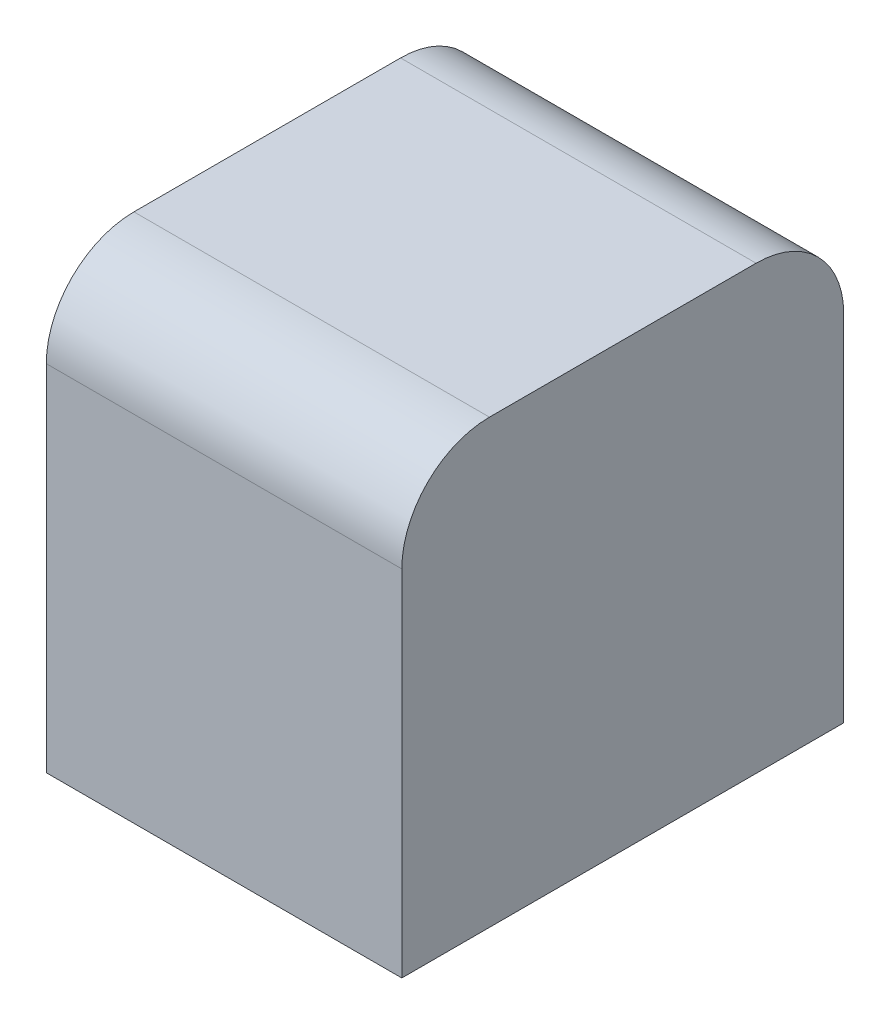
ISO-10303-21;
HEADER;
FILE_DESCRIPTION(('STEP AP214'),'2;1');
FILE_NAME('part.step','',(''),(''),'','','');
FILE_SCHEMA(('AUTOMOTIVE_DESIGN { 1 0 10303 214 1 1 1 1 }'));
ENDSEC;
DATA;
#1=APPLICATION_CONTEXT('core data for automotive mechanical design processes');
#2=APPLICATION_PROTOCOL_DEFINITION('international standard','automotive_design',2000,#1);
#3=PRODUCT_CONTEXT('',#1,'mechanical');
#4=PRODUCT('Part','Part','',(#3));
#5=PRODUCT_RELATED_PRODUCT_CATEGORY('part','',(#4));
#6=PRODUCT_DEFINITION_FORMATION('','',#4);
#7=PRODUCT_DEFINITION_CONTEXT('part definition',#1,'design');
#8=PRODUCT_DEFINITION('design','',#6,#7);
#9=PRODUCT_DEFINITION_SHAPE('','',#8);
#10=(LENGTH_UNIT() NAMED_UNIT(*) SI_UNIT(.MILLI.,.METRE.));
#11=(NAMED_UNIT(*) PLANE_ANGLE_UNIT() SI_UNIT($,.RADIAN.));
#12=(NAMED_UNIT(*) SI_UNIT($,.STERADIAN.) SOLID_ANGLE_UNIT());
#13=UNCERTAINTY_MEASURE_WITH_UNIT(LENGTH_MEASURE(1.E-05),#10,'distance_accuracy_value','');
#14=(GEOMETRIC_REPRESENTATION_CONTEXT(3) GLOBAL_UNCERTAINTY_ASSIGNED_CONTEXT((#13)) GLOBAL_UNIT_ASSIGNED_CONTEXT((#10,
#11,#12)) REPRESENTATION_CONTEXT('',''));
#15=CARTESIAN_POINT('',(0.,0.,0.));
#16=DIRECTION('',(0.,0.,1.));
#17=DIRECTION('',(1.,0.,0.));
#18=AXIS2_PLACEMENT_3D('',#15,#16,#17);
#19=CARTESIAN_POINT('',(0.2,0.,-0.25));
#20=DIRECTION('',(-1.,0.,0.));
#21=DIRECTION('',(0.,0.,1.));
#22=AXIS2_PLACEMENT_3D('',#19,#20,#21);
#23=PLANE('',#22);
#24=CARTESIAN_POINT('',(0.2,0.4,0.15));
#25=DIRECTION('',(1.,0.,0.));
#26=DIRECTION('',(0.,1.,0.));
#27=AXIS2_PLACEMENT_3D('',#24,#25,#26);
#28=CIRCLE('',#27,0.0986);
#29=CARTESIAN_POINT('',(0.2,0.4986,0.15));
#30=VERTEX_POINT('',#29);
#31=CARTESIAN_POINT('',(0.2,0.4,0.2486));
#32=VERTEX_POINT('',#31);
#33=EDGE_CURVE('E11',#30,#32,#28,.T.);
#34=ORIENTED_EDGE('',*,*,#33,.T.);
#35=DIRECTION('',(0.,1.,0.));
#36=VECTOR('',#35,1.);
#37=CARTESIAN_POINT('',(0.2,0.0014,0.2486));
#38=LINE('',#37,#36);
#39=CARTESIAN_POINT('',(0.2,0.0014,0.2486));
#40=VERTEX_POINT('',#39);
#41=EDGE_CURVE('E25',#40,#32,#38,.T.);
#42=ORIENTED_EDGE('',*,*,#41,.F.);
#43=DIRECTION('',(0.,0.,1.));
#44=VECTOR('',#43,1.);
#45=CARTESIAN_POINT('',(0.2,0.0014,-0.2486));
#46=LINE('',#45,#44);
#47=CARTESIAN_POINT('',(0.2,0.0014,-0.2486));
#48=VERTEX_POINT('',#47);
#49=EDGE_CURVE('E144',#48,#40,#46,.T.);
#50=ORIENTED_EDGE('',*,*,#49,.F.);
#51=DIRECTION('',(0.,-1.,0.));
#52=VECTOR('',#51,1.);
#53=CARTESIAN_POINT('',(0.2,0.4,-0.2486));
#54=LINE('',#53,#52);
#55=CARTESIAN_POINT('',(0.2,0.4,-0.2486));
#56=VERTEX_POINT('',#55);
#57=EDGE_CURVE('E140',#56,#48,#54,.T.);
#58=ORIENTED_EDGE('',*,*,#57,.F.);
#59=CARTESIAN_POINT('',(0.2,0.4,-0.15));
#60=DIRECTION('',(1.,0.,0.));
#61=DIRECTION('',(0.,0.,-1.));
#62=AXIS2_PLACEMENT_3D('',#59,#60,#61);
#63=CIRCLE('',#62,0.0986);
#64=CARTESIAN_POINT('',(0.2,0.4986,-0.15));
#65=VERTEX_POINT('',#64);
#66=EDGE_CURVE('E89',#56,#65,#63,.T.);
#67=ORIENTED_EDGE('',*,*,#66,.T.);
#68=DIRECTION('',(0.,0.,-1.));
#69=VECTOR('',#68,1.);
#70=CARTESIAN_POINT('',(0.2,0.4986,0.15));
#71=LINE('',#70,#69);
#72=EDGE_CURVE('E132',#30,#65,#71,.T.);
#73=ORIENTED_EDGE('',*,*,#72,.F.);
#74=EDGE_LOOP('',(#34,#42,#50,#58,#67,#73));
#75=FACE_BOUND('',#74,.T.);
#76=ADVANCED_FACE('F17',(#75),#23,.F.);
#77=CARTESIAN_POINT('',(-0.2,0.4986,0.15));
#78=DIRECTION('',(0.,-1.,0.));
#79=DIRECTION('',(0.,0.,-1.));
#80=AXIS2_PLACEMENT_3D('',#77,#78,#79);
#81=PLANE('',#80);
#82=DIRECTION('',(1.,0.,0.));
#83=VECTOR('',#82,1.);
#84=CARTESIAN_POINT('',(-0.2,0.4986,-0.15));
#85=LINE('',#84,#83);
#86=CARTESIAN_POINT('',(-0.2,0.4986,-0.15));
#87=VERTEX_POINT('',#86);
#88=EDGE_CURVE('E128',#87,#65,#85,.T.);
#89=ORIENTED_EDGE('',*,*,#88,.F.);
#90=DIRECTION('',(0.,0.,-1.));
#91=VECTOR('',#90,1.);
#92=CARTESIAN_POINT('',(-0.2,0.4986,0.15));
#93=LINE('',#92,#91);
#94=CARTESIAN_POINT('',(-0.2,0.4986,0.15));
#95=VERTEX_POINT('',#94);
#96=EDGE_CURVE('E84',#95,#87,#93,.T.);
#97=ORIENTED_EDGE('',*,*,#96,.F.);
#98=DIRECTION('',(1.,0.,0.));
#99=VECTOR('',#98,1.);
#100=CARTESIAN_POINT('',(-0.2,0.4986,0.15));
#101=LINE('',#100,#99);
#102=EDGE_CURVE('E120',#95,#30,#101,.T.);
#103=ORIENTED_EDGE('',*,*,#102,.T.);
#104=ORIENTED_EDGE('',*,*,#72,.T.);
#105=EDGE_LOOP('',(#89,#97,#103,#104));
#106=FACE_BOUND('',#105,.T.);
#107=ADVANCED_FACE('F160',(#106),#81,.F.);
#108=CARTESIAN_POINT('',(-0.2,0.4,0.15));
#109=DIRECTION('',(1.,0.,0.));
#110=DIRECTION('',(0.,-0.707106781186548,-0.707106781186548));
#111=AXIS2_PLACEMENT_3D('',#108,#109,#110);
#112=CYLINDRICAL_SURFACE('',#111,0.0986);
#113=ORIENTED_EDGE('',*,*,#102,.F.);
#114=CARTESIAN_POINT('',(-0.2,0.4,0.15));
#115=DIRECTION('',(1.,0.,0.));
#116=DIRECTION('',(0.,1.,0.));
#117=AXIS2_PLACEMENT_3D('',#114,#115,#116);
#118=CIRCLE('',#117,0.0986);
#119=CARTESIAN_POINT('',(-0.2,0.4,0.2486));
#120=VERTEX_POINT('',#119);
#121=EDGE_CURVE('E116',#95,#120,#118,.T.);
#122=ORIENTED_EDGE('',*,*,#121,.T.);
#123=DIRECTION('',(1.,0.,0.));
#124=VECTOR('',#123,1.);
#125=CARTESIAN_POINT('',(-0.2,0.4,0.2486));
#126=LINE('',#125,#124);
#127=EDGE_CURVE('E112',#120,#32,#126,.T.);
#128=ORIENTED_EDGE('',*,*,#127,.T.);
#129=ORIENTED_EDGE('',*,*,#33,.F.);
#130=EDGE_LOOP('',(#113,#122,#128,#129));
#131=FACE_BOUND('',#130,.T.);
#132=ADVANCED_FACE('F163',(#131),#112,.T.);
#133=CARTESIAN_POINT('',(-0.2,0.0014,0.2486));
#134=DIRECTION('',(0.,0.,-1.));
#135=DIRECTION('',(0.,1.,0.));
#136=AXIS2_PLACEMENT_3D('',#133,#134,#135);
#137=PLANE('',#136);
#138=ORIENTED_EDGE('',*,*,#127,.F.);
#139=DIRECTION('',(0.,1.,0.));
#140=VECTOR('',#139,1.);
#141=CARTESIAN_POINT('',(-0.2,0.0014,0.2486));
#142=LINE('',#141,#140);
#143=CARTESIAN_POINT('',(-0.2,0.0014,0.2486));
#144=VERTEX_POINT('',#143);
#145=EDGE_CURVE('E107',#144,#120,#142,.T.);
#146=ORIENTED_EDGE('',*,*,#145,.F.);
#147=DIRECTION('',(1.,0.,0.));
#148=VECTOR('',#147,1.);
#149=CARTESIAN_POINT('',(-0.2,0.0014,0.2486));
#150=LINE('',#149,#148);
#151=EDGE_CURVE('E103',#144,#40,#150,.T.);
#152=ORIENTED_EDGE('',*,*,#151,.T.);
#153=ORIENTED_EDGE('',*,*,#41,.T.);
#154=EDGE_LOOP('',(#138,#146,#152,#153));
#155=FACE_BOUND('',#154,.T.);
#156=ADVANCED_FACE('F155',(#155),#137,.F.);
#157=CARTESIAN_POINT('',(-0.2,0.0014,-0.2486));
#158=DIRECTION('',(0.,1.,0.));
#159=DIRECTION('',(0.,0.,1.));
#160=AXIS2_PLACEMENT_3D('',#157,#158,#159);
#161=PLANE('',#160);
#162=ORIENTED_EDGE('',*,*,#151,.F.);
#163=DIRECTION('',(0.,0.,1.));
#164=VECTOR('',#163,1.);
#165=CARTESIAN_POINT('',(-0.2,0.0014,-0.2486));
#166=LINE('',#165,#164);
#167=CARTESIAN_POINT('',(-0.2,0.0014,-0.2486));
#168=VERTEX_POINT('',#167);
#169=EDGE_CURVE('E99',#168,#144,#166,.T.);
#170=ORIENTED_EDGE('',*,*,#169,.F.);
#171=DIRECTION('',(1.,0.,0.));
#172=VECTOR('',#171,1.);
#173=CARTESIAN_POINT('',(-0.2,0.0014,-0.2486));
#174=LINE('',#173,#172);
#175=EDGE_CURVE('E75',#168,#48,#174,.T.);
#176=ORIENTED_EDGE('',*,*,#175,.T.);
#177=ORIENTED_EDGE('',*,*,#49,.T.);
#178=EDGE_LOOP('',(#162,#170,#176,#177));
#179=FACE_BOUND('',#178,.T.);
#180=ADVANCED_FACE('F158',(#179),#161,.F.);
#181=CARTESIAN_POINT('',(-0.2,0.4,-0.2486));
#182=DIRECTION('',(0.,0.,1.));
#183=DIRECTION('',(0.,-1.,0.));
#184=AXIS2_PLACEMENT_3D('',#181,#182,#183);
#185=PLANE('',#184);
#186=ORIENTED_EDGE('',*,*,#175,.F.);
#187=DIRECTION('',(0.,-1.,0.));
#188=VECTOR('',#187,1.);
#189=CARTESIAN_POINT('',(-0.2,0.4,-0.2486));
#190=LINE('',#189,#188);
#191=CARTESIAN_POINT('',(-0.2,0.4,-0.2486));
#192=VERTEX_POINT('',#191);
#193=EDGE_CURVE('E67',#192,#168,#190,.T.);
#194=ORIENTED_EDGE('',*,*,#193,.F.);
#195=DIRECTION('',(1.,0.,0.));
#196=VECTOR('',#195,1.);
#197=CARTESIAN_POINT('',(-0.2,0.4,-0.2486));
#198=LINE('',#197,#196);
#199=EDGE_CURVE('E72',#192,#56,#198,.T.);
#200=ORIENTED_EDGE('',*,*,#199,.T.);
#201=ORIENTED_EDGE('',*,*,#57,.T.);
#202=EDGE_LOOP('',(#186,#194,#200,#201));
#203=FACE_BOUND('',#202,.T.);
#204=ADVANCED_FACE('F69',(#203),#185,.F.);
#205=CARTESIAN_POINT('',(-0.2,0.4,-0.15));
#206=DIRECTION('',(1.,0.,0.));
#207=DIRECTION('',(0.,-0.707106781186548,0.707106781186547));
#208=AXIS2_PLACEMENT_3D('',#205,#206,#207);
#209=CYLINDRICAL_SURFACE('',#208,0.0986);
#210=ORIENTED_EDGE('',*,*,#199,.F.);
#211=CARTESIAN_POINT('',(-0.2,0.4,-0.15));
#212=DIRECTION('',(1.,0.,0.));
#213=DIRECTION('',(0.,0.,-1.));
#214=AXIS2_PLACEMENT_3D('',#211,#212,#213);
#215=CIRCLE('',#214,0.0986);
#216=EDGE_CURVE('E81',#192,#87,#215,.T.);
#217=ORIENTED_EDGE('',*,*,#216,.T.);
#218=ORIENTED_EDGE('',*,*,#88,.T.);
#219=ORIENTED_EDGE('',*,*,#66,.F.);
#220=EDGE_LOOP('',(#210,#217,#218,#219));
#221=FACE_BOUND('',#220,.T.);
#222=ADVANCED_FACE('F88',(#221),#209,.T.);
#223=CARTESIAN_POINT('',(-0.2,0.,0.35));
#224=DIRECTION('',(1.,0.,0.));
#225=DIRECTION('',(0.,0.,-1.));
#226=AXIS2_PLACEMENT_3D('',#223,#224,#225);
#227=PLANE('',#226);
#228=ORIENTED_EDGE('',*,*,#216,.F.);
#229=ORIENTED_EDGE('',*,*,#193,.T.);
#230=ORIENTED_EDGE('',*,*,#169,.T.);
#231=ORIENTED_EDGE('',*,*,#145,.T.);
#232=ORIENTED_EDGE('',*,*,#121,.F.);
#233=ORIENTED_EDGE('',*,*,#96,.T.);
#234=EDGE_LOOP('',(#228,#229,#230,#231,#232,#233));
#235=FACE_BOUND('',#234,.T.);
#236=ADVANCED_FACE('F82',(#235),#227,.F.);
#237=CLOSED_SHELL('',(#76,#107,#132,#156,#180,#204,#222,#236));
#238=MANIFOLD_SOLID_BREP('B1',#237);
#239=ADVANCED_BREP_SHAPE_REPRESENTATION('',(#18,#238),#14);
#240=SHAPE_DEFINITION_REPRESENTATION(#9,#239);
ENDSEC;
END-ISO-10303-21;
